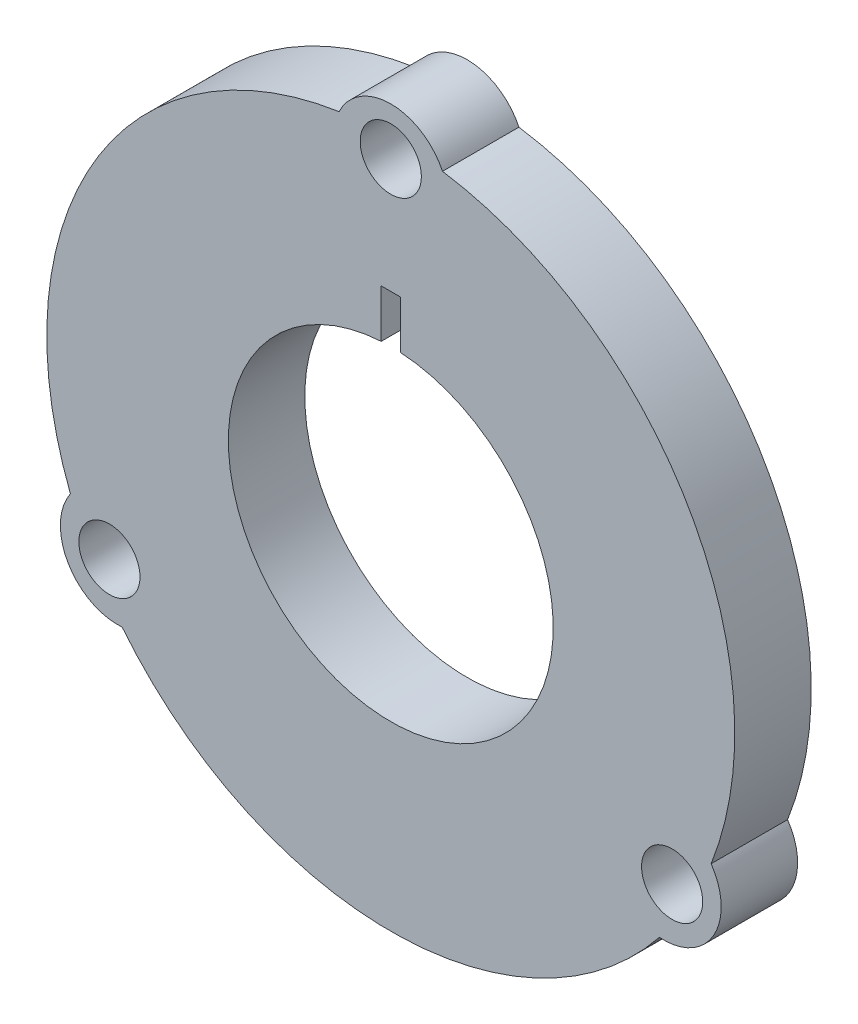
ISO-10303-21;
HEADER;
FILE_DESCRIPTION(('STEP AP214'),'2;1');
FILE_NAME('part.step','',(''),(''),'','','');
FILE_SCHEMA(('AUTOMOTIVE_DESIGN { 1 0 10303 214 1 1 1 1 }'));
ENDSEC;
DATA;
#1=APPLICATION_CONTEXT('core data for automotive mechanical design processes');
#2=APPLICATION_PROTOCOL_DEFINITION('international standard','automotive_design',2000,#1);
#3=PRODUCT_CONTEXT('',#1,'mechanical');
#4=PRODUCT('Part','Part','',(#3));
#5=PRODUCT_RELATED_PRODUCT_CATEGORY('part','',(#4));
#6=PRODUCT_DEFINITION_FORMATION('','',#4);
#7=PRODUCT_DEFINITION_CONTEXT('part definition',#1,'design');
#8=PRODUCT_DEFINITION('design','',#6,#7);
#9=PRODUCT_DEFINITION_SHAPE('','',#8);
#10=(LENGTH_UNIT() NAMED_UNIT(*) SI_UNIT(.MILLI.,.METRE.));
#11=(NAMED_UNIT(*) PLANE_ANGLE_UNIT() SI_UNIT($,.RADIAN.));
#12=(NAMED_UNIT(*) SI_UNIT($,.STERADIAN.) SOLID_ANGLE_UNIT());
#13=UNCERTAINTY_MEASURE_WITH_UNIT(LENGTH_MEASURE(1.E-05),#10,'distance_accuracy_value','');
#14=(GEOMETRIC_REPRESENTATION_CONTEXT(3) GLOBAL_UNCERTAINTY_ASSIGNED_CONTEXT((#13)) GLOBAL_UNIT_ASSIGNED_CONTEXT((#10,
#11,#12)) REPRESENTATION_CONTEXT('',''));
#15=CARTESIAN_POINT('',(0.,0.,0.));
#16=DIRECTION('',(0.,0.,1.));
#17=DIRECTION('',(1.,0.,0.));
#18=AXIS2_PLACEMENT_3D('',#15,#16,#17);
#19=CARTESIAN_POINT('',(0.,8.25,4.));
#20=DIRECTION('',(0.,0.,1.));
#21=DIRECTION('',(1.,0.,0.));
#22=AXIS2_PLACEMENT_3D('',#19,#20,#21);
#23=PLANE('',#22);
#24=CARTESIAN_POINT('',(0.,17.,4.));
#25=DIRECTION('',(0.,0.,1.));
#26=DIRECTION('',(1.,0.,0.));
#27=AXIS2_PLACEMENT_3D('',#24,#25,#26);
#28=CIRCLE('',#27,1.6);
#29=CARTESIAN_POINT('',(1.6,17.,4.));
#30=VERTEX_POINT('',#29);
#31=EDGE_CURVE('E154',#30,#30,#28,.T.);
#32=ORIENTED_EDGE('',*,*,#31,.F.);
#33=EDGE_LOOP('',(#32));
#34=FACE_BOUND('',#33,.T.);
#35=CARTESIAN_POINT('',(14.7224318643365,-8.49999999999936,4.));
#36=DIRECTION('',(0.,0.,1.));
#37=DIRECTION('',(1.,0.,0.));
#38=AXIS2_PLACEMENT_3D('',#35,#36,#37);
#39=CIRCLE('',#38,1.60000000000094);
#40=CARTESIAN_POINT('',(16.3224318643375,-8.49999999999936,4.));
#41=VERTEX_POINT('',#40);
#42=EDGE_CURVE('E322',#41,#41,#39,.T.);
#43=ORIENTED_EDGE('',*,*,#42,.F.);
#44=EDGE_LOOP('',(#43));
#45=FACE_BOUND('',#44,.T.);
#46=CARTESIAN_POINT('',(-14.7224318643344,-8.50000000000063,4.));
#47=DIRECTION('',(0.,0.,1.));
#48=DIRECTION('',(1.,0.,0.));
#49=AXIS2_PLACEMENT_3D('',#46,#47,#48);
#50=CIRCLE('',#49,1.60000000000137);
#51=CARTESIAN_POINT('',(-13.122431864333,-8.50000000000063,4.));
#52=VERTEX_POINT('',#51);
#53=EDGE_CURVE('E176',#52,#52,#50,.T.);
#54=ORIENTED_EDGE('',*,*,#53,.F.);
#55=EDGE_LOOP('',(#54));
#56=FACE_BOUND('',#55,.T.);
#57=CARTESIAN_POINT('',(0.,0.,4.));
#58=DIRECTION('',(0.,0.,1.));
#59=DIRECTION('',(1.,0.,0.));
#60=AXIS2_PLACEMENT_3D('',#57,#58,#59);
#61=CIRCLE('',#60,18.);
#62=CARTESIAN_POINT('',(16.7642567195958,-6.55436470144018,4.));
#63=VERTEX_POINT('',#62);
#64=CARTESIAN_POINT('',(2.70588202268129,17.7954545454543,4.));
#65=VERTEX_POINT('',#64);
#66=EDGE_CURVE('E142',#63,#65,#61,.T.);
#67=ORIENTED_EDGE('',*,*,#66,.T.);
#68=CARTESIAN_POINT('',(0.,16.5,4.));
#69=DIRECTION('',(0.,0.,1.));
#70=DIRECTION('',(1.,0.,0.));
#71=AXIS2_PLACEMENT_3D('',#68,#69,#70);
#72=CIRCLE('',#71,3.00000000000133);
#73=CARTESIAN_POINT('',(-2.70588202268129,17.7954545454543,4.));
#74=VERTEX_POINT('',#73);
#75=EDGE_CURVE('E93',#65,#74,#72,.T.);
#76=ORIENTED_EDGE('',*,*,#75,.T.);
#77=CARTESIAN_POINT('',(0.,0.,4.));
#78=DIRECTION('',(0.,0.,1.));
#79=DIRECTION('',(1.,0.,0.));
#80=AXIS2_PLACEMENT_3D('',#77,#78,#79);
#81=CIRCLE('',#80,18.);
#82=CARTESIAN_POINT('',(-16.7642567195948,-6.55436470144291,4.));
#83=VERTEX_POINT('',#82);
#84=EDGE_CURVE('E109',#74,#83,#81,.T.);
#85=ORIENTED_EDGE('',*,*,#84,.T.);
#86=CARTESIAN_POINT('',(-14.2894191624422,-8.25000000000061,4.));
#87=DIRECTION('',(0.,0.,1.));
#88=DIRECTION('',(1.,0.,0.));
#89=AXIS2_PLACEMENT_3D('',#86,#87,#88);
#90=CIRCLE('',#89,3.00000000000133);
#91=CARTESIAN_POINT('',(-14.0583746969135,-11.2410898440134,4.));
#92=VERTEX_POINT('',#91);
#93=EDGE_CURVE('E102',#83,#92,#90,.T.);
#94=ORIENTED_EDGE('',*,*,#93,.T.);
#95=CARTESIAN_POINT('',(0.,0.,4.));
#96=DIRECTION('',(0.,0.,1.));
#97=DIRECTION('',(1.,0.,0.));
#98=AXIS2_PLACEMENT_3D('',#95,#96,#97);
#99=CIRCLE('',#98,18.);
#100=CARTESIAN_POINT('',(14.0583746969146,-11.2410898440121,4.));
#101=VERTEX_POINT('',#100);
#102=EDGE_CURVE('E106',#92,#101,#99,.T.);
#103=ORIENTED_EDGE('',*,*,#102,.T.);
#104=CARTESIAN_POINT('',(14.2894191624443,-8.24999999999938,4.));
#105=DIRECTION('',(0.,0.,1.));
#106=DIRECTION('',(1.,0.,0.));
#107=AXIS2_PLACEMENT_3D('',#104,#105,#106);
#108=CIRCLE('',#107,3.00000000000128);
#109=EDGE_CURVE('E57',#101,#63,#108,.T.);
#110=ORIENTED_EDGE('',*,*,#109,.T.);
#111=EDGE_LOOP('',(#67,#76,#85,#94,#103,#110));
#112=FACE_BOUND('',#111,.T.);
#113=DIRECTION('',(1.,0.,0.));
#114=VECTOR('',#113,1.);
#115=CARTESIAN_POINT('',(0.,11.,4.));
#116=LINE('',#115,#114);
#117=CARTESIAN_POINT('',(-0.5,11.,4.));
#118=VERTEX_POINT('',#117);
#119=CARTESIAN_POINT('',(0.5,11.,4.));
#120=VERTEX_POINT('',#119);
#121=EDGE_CURVE('E316',#118,#120,#116,.T.);
#122=ORIENTED_EDGE('',*,*,#121,.T.);
#123=DIRECTION('',(0.,-1.,0.));
#124=VECTOR('',#123,1.);
#125=CARTESIAN_POINT('',(0.5,0.,4.));
#126=LINE('',#125,#124);
#127=CARTESIAN_POINT('',(0.5,8.48528137423857,4.));
#128=VERTEX_POINT('',#127);
#129=EDGE_CURVE('E351',#120,#128,#126,.T.);
#130=ORIENTED_EDGE('',*,*,#129,.T.);
#131=CARTESIAN_POINT('',(0.,0.,4.));
#132=DIRECTION('',(0.,0.,1.));
#133=DIRECTION('',(1.,0.,0.));
#134=AXIS2_PLACEMENT_3D('',#131,#132,#133);
#135=CIRCLE('',#134,8.5);
#136=CARTESIAN_POINT('',(-0.5,8.48528137423857,4.));
#137=VERTEX_POINT('',#136);
#138=EDGE_CURVE('E134',#137,#128,#135,.T.);
#139=ORIENTED_EDGE('',*,*,#138,.F.);
#140=DIRECTION('',(0.,1.,0.));
#141=VECTOR('',#140,1.);
#142=CARTESIAN_POINT('',(-0.5,0.,4.));
#143=LINE('',#142,#141);
#144=EDGE_CURVE('E48',#137,#118,#143,.T.);
#145=ORIENTED_EDGE('',*,*,#144,.T.);
#146=EDGE_LOOP('',(#122,#130,#139,#145));
#147=FACE_BOUND('',#146,.T.);
#148=ADVANCED_FACE('F33',(#34,#45,#56,#112,#147),#23,.T.);
#149=CARTESIAN_POINT('',(0.,8.25,0.));
#150=DIRECTION('',(0.,0.,1.));
#151=DIRECTION('',(1.,0.,0.));
#152=AXIS2_PLACEMENT_3D('',#149,#150,#151);
#153=PLANE('',#152);
#154=CARTESIAN_POINT('',(0.,0.,0.));
#155=DIRECTION('',(0.,0.,1.));
#156=DIRECTION('',(1.,0.,0.));
#157=AXIS2_PLACEMENT_3D('',#154,#155,#156);
#158=CIRCLE('',#157,18.);
#159=CARTESIAN_POINT('',(16.7642567195958,-6.55436470144018,0.));
#160=VERTEX_POINT('',#159);
#161=CARTESIAN_POINT('',(2.70588202268129,17.7954545454543,0.));
#162=VERTEX_POINT('',#161);
#163=EDGE_CURVE('E130',#160,#162,#158,.T.);
#164=ORIENTED_EDGE('',*,*,#163,.F.);
#165=CARTESIAN_POINT('',(14.2894191624443,-8.24999999999938,0.));
#166=DIRECTION('',(0.,0.,1.));
#167=DIRECTION('',(1.,0.,0.));
#168=AXIS2_PLACEMENT_3D('',#165,#166,#167);
#169=CIRCLE('',#168,3.00000000000128);
#170=CARTESIAN_POINT('',(14.0583746969146,-11.2410898440121,0.));
#171=VERTEX_POINT('',#170);
#172=EDGE_CURVE('E84',#171,#160,#169,.T.);
#173=ORIENTED_EDGE('',*,*,#172,.F.);
#174=CARTESIAN_POINT('',(0.,0.,0.));
#175=DIRECTION('',(0.,0.,1.));
#176=DIRECTION('',(1.,0.,0.));
#177=AXIS2_PLACEMENT_3D('',#174,#175,#176);
#178=CIRCLE('',#177,18.);
#179=CARTESIAN_POINT('',(-14.0583746969135,-11.2410898440134,0.));
#180=VERTEX_POINT('',#179);
#181=EDGE_CURVE('E139',#180,#171,#178,.T.);
#182=ORIENTED_EDGE('',*,*,#181,.F.);
#183=CARTESIAN_POINT('',(-14.2894191624422,-8.25000000000061,0.));
#184=DIRECTION('',(0.,0.,1.));
#185=DIRECTION('',(1.,0.,0.));
#186=AXIS2_PLACEMENT_3D('',#183,#184,#185);
#187=CIRCLE('',#186,3.00000000000133);
#188=CARTESIAN_POINT('',(-16.7642567195948,-6.55436470144291,0.));
#189=VERTEX_POINT('',#188);
#190=EDGE_CURVE('E118',#189,#180,#187,.T.);
#191=ORIENTED_EDGE('',*,*,#190,.F.);
#192=CARTESIAN_POINT('',(0.,0.,0.));
#193=DIRECTION('',(0.,0.,1.));
#194=DIRECTION('',(1.,0.,0.));
#195=AXIS2_PLACEMENT_3D('',#192,#193,#194);
#196=CIRCLE('',#195,18.);
#197=CARTESIAN_POINT('',(-2.70588202268129,17.7954545454543,0.));
#198=VERTEX_POINT('',#197);
#199=EDGE_CURVE('E136',#198,#189,#196,.T.);
#200=ORIENTED_EDGE('',*,*,#199,.F.);
#201=CARTESIAN_POINT('',(0.,16.5,0.));
#202=DIRECTION('',(0.,0.,1.));
#203=DIRECTION('',(1.,0.,0.));
#204=AXIS2_PLACEMENT_3D('',#201,#202,#203);
#205=CIRCLE('',#204,3.00000000000133);
#206=EDGE_CURVE('E133',#162,#198,#205,.T.);
#207=ORIENTED_EDGE('',*,*,#206,.F.);
#208=EDGE_LOOP('',(#164,#173,#182,#191,#200,#207));
#209=FACE_BOUND('',#208,.T.);
#210=CARTESIAN_POINT('',(-14.7224318643344,-8.50000000000063,0.));
#211=DIRECTION('',(0.,0.,1.));
#212=DIRECTION('',(1.,0.,0.));
#213=AXIS2_PLACEMENT_3D('',#210,#211,#212);
#214=CIRCLE('',#213,1.60000000000137);
#215=CARTESIAN_POINT('',(-13.122431864333,-8.50000000000063,0.));
#216=VERTEX_POINT('',#215);
#217=EDGE_CURVE('E150',#216,#216,#214,.T.);
#218=ORIENTED_EDGE('',*,*,#217,.T.);
#219=EDGE_LOOP('',(#218));
#220=FACE_BOUND('',#219,.T.);
#221=CARTESIAN_POINT('',(14.7224318643365,-8.49999999999936,0.));
#222=DIRECTION('',(0.,0.,1.));
#223=DIRECTION('',(1.,0.,0.));
#224=AXIS2_PLACEMENT_3D('',#221,#222,#223);
#225=CIRCLE('',#224,1.60000000000094);
#226=CARTESIAN_POINT('',(16.3224318643375,-8.49999999999936,0.));
#227=VERTEX_POINT('',#226);
#228=EDGE_CURVE('E153',#227,#227,#225,.T.);
#229=ORIENTED_EDGE('',*,*,#228,.T.);
#230=EDGE_LOOP('',(#229));
#231=FACE_BOUND('',#230,.T.);
#232=CARTESIAN_POINT('',(0.,17.,0.));
#233=DIRECTION('',(0.,0.,1.));
#234=DIRECTION('',(1.,0.,0.));
#235=AXIS2_PLACEMENT_3D('',#232,#233,#234);
#236=CIRCLE('',#235,1.6);
#237=CARTESIAN_POINT('',(1.6,17.,0.));
#238=VERTEX_POINT('',#237);
#239=EDGE_CURVE('E157',#238,#238,#236,.T.);
#240=ORIENTED_EDGE('',*,*,#239,.T.);
#241=EDGE_LOOP('',(#240));
#242=FACE_BOUND('',#241,.T.);
#243=DIRECTION('',(0.,-1.,0.));
#244=VECTOR('',#243,1.);
#245=CARTESIAN_POINT('',(0.5,8.25,0.));
#246=LINE('',#245,#244);
#247=CARTESIAN_POINT('',(0.5,11.,0.));
#248=VERTEX_POINT('',#247);
#249=CARTESIAN_POINT('',(0.5,8.48528137423857,-6.E-06));
#250=VERTEX_POINT('',#249);
#251=EDGE_CURVE('E310',#248,#250,#246,.T.);
#252=ORIENTED_EDGE('',*,*,#251,.F.);
#253=DIRECTION('',(1.,0.,0.));
#254=VECTOR('',#253,1.);
#255=CARTESIAN_POINT('',(0.,11.,0.));
#256=LINE('',#255,#254);
#257=CARTESIAN_POINT('',(-0.5,11.,0.));
#258=VERTEX_POINT('',#257);
#259=EDGE_CURVE('E11',#258,#248,#256,.T.);
#260=ORIENTED_EDGE('',*,*,#259,.F.);
#261=DIRECTION('',(0.,1.,0.));
#262=VECTOR('',#261,1.);
#263=CARTESIAN_POINT('',(-0.5,8.25,0.));
#264=LINE('',#263,#262);
#265=CARTESIAN_POINT('',(-0.5,8.48528137423857,0.));
#266=VERTEX_POINT('',#265);
#267=EDGE_CURVE('E302',#266,#258,#264,.T.);
#268=ORIENTED_EDGE('',*,*,#267,.F.);
#269=CARTESIAN_POINT('',(0.,0.,0.));
#270=DIRECTION('',(0.,0.,1.));
#271=DIRECTION('',(1.,0.,0.));
#272=AXIS2_PLACEMENT_3D('',#269,#270,#271);
#273=CIRCLE('',#272,8.5);
#274=EDGE_CURVE('E160',#266,#250,#273,.T.);
#275=ORIENTED_EDGE('',*,*,#274,.T.);
#276=EDGE_LOOP('',(#252,#260,#268,#275));
#277=FACE_BOUND('',#276,.T.);
#278=ADVANCED_FACE('F187',(#209,#220,#231,#242,#277),#153,.F.);
#279=CARTESIAN_POINT('',(0.,0.,4.));
#280=DIRECTION('',(0.,0.,-1.));
#281=DIRECTION('',(-1.,0.,0.));
#282=AXIS2_PLACEMENT_3D('',#279,#280,#281);
#283=CYLINDRICAL_SURFACE('',#282,8.5);
#284=ORIENTED_EDGE('',*,*,#138,.T.);
#285=DIRECTION('',(0.,0.,-1.));
#286=VECTOR('',#285,1.);
#287=CARTESIAN_POINT('',(0.5,8.48528137423857,4.));
#288=LINE('',#287,#286);
#289=EDGE_CURVE('E346',#128,#250,#288,.T.);
#290=ORIENTED_EDGE('',*,*,#289,.T.);
#291=ORIENTED_EDGE('',*,*,#274,.F.);
#292=DIRECTION('',(0.,0.,-1.));
#293=VECTOR('',#292,1.);
#294=CARTESIAN_POINT('',(-0.5,8.48528137423857,4.));
#295=LINE('',#294,#293);
#296=EDGE_CURVE('E308',#137,#266,#295,.T.);
#297=ORIENTED_EDGE('',*,*,#296,.F.);
#298=EDGE_LOOP('',(#284,#290,#291,#297));
#299=FACE_BOUND('',#298,.T.);
#300=ADVANCED_FACE('F192',(#299),#283,.F.);
#301=CARTESIAN_POINT('',(0.,0.,4.));
#302=DIRECTION('',(0.,0.,-1.));
#303=DIRECTION('',(-1.,0.,0.));
#304=AXIS2_PLACEMENT_3D('',#301,#302,#303);
#305=CYLINDRICAL_SURFACE('',#304,18.);
#306=ORIENTED_EDGE('',*,*,#163,.T.);
#307=DIRECTION('',(0.,0.,-1.));
#308=VECTOR('',#307,1.);
#309=CARTESIAN_POINT('',(2.70588202268129,17.7954545454543,4.));
#310=LINE('',#309,#308);
#311=EDGE_CURVE('E41',#65,#162,#310,.T.);
#312=ORIENTED_EDGE('',*,*,#311,.F.);
#313=ORIENTED_EDGE('',*,*,#66,.F.);
#314=DIRECTION('',(0.,0.,-1.));
#315=VECTOR('',#314,1.);
#316=CARTESIAN_POINT('',(16.7642567195958,-6.55436470144018,4.));
#317=LINE('',#316,#315);
#318=EDGE_CURVE('E126',#63,#160,#317,.T.);
#319=ORIENTED_EDGE('',*,*,#318,.T.);
#320=EDGE_LOOP('',(#306,#312,#313,#319));
#321=FACE_BOUND('',#320,.T.);
#322=ADVANCED_FACE('F35',(#321),#305,.T.);
#323=CARTESIAN_POINT('',(0.,16.5,4.));
#324=DIRECTION('',(0.,0.,-1.));
#325=DIRECTION('',(-1.,0.,0.));
#326=AXIS2_PLACEMENT_3D('',#323,#324,#325);
#327=CYLINDRICAL_SURFACE('',#326,3.00000000000133);
#328=ORIENTED_EDGE('',*,*,#206,.T.);
#329=DIRECTION('',(0.,0.,-1.));
#330=VECTOR('',#329,1.);
#331=CARTESIAN_POINT('',(-2.70588202268129,17.7954545454543,4.));
#332=LINE('',#331,#330);
#333=EDGE_CURVE('E146',#74,#198,#332,.T.);
#334=ORIENTED_EDGE('',*,*,#333,.F.);
#335=ORIENTED_EDGE('',*,*,#75,.F.);
#336=ORIENTED_EDGE('',*,*,#311,.T.);
#337=EDGE_LOOP('',(#328,#334,#335,#336));
#338=FACE_BOUND('',#337,.T.);
#339=ADVANCED_FACE('F181',(#338),#327,.T.);
#340=CARTESIAN_POINT('',(0.,0.,4.));
#341=DIRECTION('',(0.,0.,-1.));
#342=DIRECTION('',(-1.,0.,0.));
#343=AXIS2_PLACEMENT_3D('',#340,#341,#342);
#344=CYLINDRICAL_SURFACE('',#343,18.);
#345=ORIENTED_EDGE('',*,*,#199,.T.);
#346=DIRECTION('',(0.,0.,-1.));
#347=VECTOR('',#346,1.);
#348=CARTESIAN_POINT('',(-16.7642567195948,-6.55436470144291,4.));
#349=LINE('',#348,#347);
#350=EDGE_CURVE('E121',#83,#189,#349,.T.);
#351=ORIENTED_EDGE('',*,*,#350,.F.);
#352=ORIENTED_EDGE('',*,*,#84,.F.);
#353=ORIENTED_EDGE('',*,*,#333,.T.);
#354=EDGE_LOOP('',(#345,#351,#352,#353));
#355=FACE_BOUND('',#354,.T.);
#356=ADVANCED_FACE('F184',(#355),#344,.T.);
#357=CARTESIAN_POINT('',(-14.2894191624422,-8.25000000000061,4.));
#358=DIRECTION('',(0.,0.,-1.));
#359=DIRECTION('',(-1.,0.,0.));
#360=AXIS2_PLACEMENT_3D('',#357,#358,#359);
#361=CYLINDRICAL_SURFACE('',#360,3.00000000000133);
#362=ORIENTED_EDGE('',*,*,#190,.T.);
#363=DIRECTION('',(0.,0.,-1.));
#364=VECTOR('',#363,1.);
#365=CARTESIAN_POINT('',(-14.0583746969135,-11.2410898440134,4.));
#366=LINE('',#365,#364);
#367=EDGE_CURVE('E115',#92,#180,#366,.T.);
#368=ORIENTED_EDGE('',*,*,#367,.F.);
#369=ORIENTED_EDGE('',*,*,#93,.F.);
#370=ORIENTED_EDGE('',*,*,#350,.T.);
#371=EDGE_LOOP('',(#362,#368,#369,#370));
#372=FACE_BOUND('',#371,.T.);
#373=ADVANCED_FACE('F116',(#372),#361,.T.);
#374=CARTESIAN_POINT('',(0.,0.,4.));
#375=DIRECTION('',(0.,0.,-1.));
#376=DIRECTION('',(-1.,0.,0.));
#377=AXIS2_PLACEMENT_3D('',#374,#375,#376);
#378=CYLINDRICAL_SURFACE('',#377,18.);
#379=ORIENTED_EDGE('',*,*,#181,.T.);
#380=DIRECTION('',(0.,0.,-1.));
#381=VECTOR('',#380,1.);
#382=CARTESIAN_POINT('',(14.0583746969146,-11.2410898440121,4.));
#383=LINE('',#382,#381);
#384=EDGE_CURVE('E122',#101,#171,#383,.T.);
#385=ORIENTED_EDGE('',*,*,#384,.F.);
#386=ORIENTED_EDGE('',*,*,#102,.F.);
#387=ORIENTED_EDGE('',*,*,#367,.T.);
#388=EDGE_LOOP('',(#379,#385,#386,#387));
#389=FACE_BOUND('',#388,.T.);
#390=ADVANCED_FACE('F124',(#389),#378,.T.);
#391=CARTESIAN_POINT('',(14.2894191624443,-8.24999999999938,4.));
#392=DIRECTION('',(0.,0.,-1.));
#393=DIRECTION('',(-1.,0.,0.));
#394=AXIS2_PLACEMENT_3D('',#391,#392,#393);
#395=CYLINDRICAL_SURFACE('',#394,3.00000000000128);
#396=ORIENTED_EDGE('',*,*,#172,.T.);
#397=ORIENTED_EDGE('',*,*,#318,.F.);
#398=ORIENTED_EDGE('',*,*,#109,.F.);
#399=ORIENTED_EDGE('',*,*,#384,.T.);
#400=EDGE_LOOP('',(#396,#397,#398,#399));
#401=FACE_BOUND('',#400,.T.);
#402=ADVANCED_FACE('F189',(#401),#395,.T.);
#403=CARTESIAN_POINT('',(-14.7224318643344,-8.50000000000063,-6.));
#404=DIRECTION('',(0.,0.,1.));
#405=DIRECTION('',(1.,0.,0.));
#406=AXIS2_PLACEMENT_3D('',#403,#404,#405);
#407=CYLINDRICAL_SURFACE('',#406,1.60000000000137);
#408=ORIENTED_EDGE('',*,*,#53,.T.);
#409=EDGE_LOOP('',(#408));
#410=FACE_BOUND('',#409,.T.);
#411=ORIENTED_EDGE('',*,*,#217,.F.);
#412=EDGE_LOOP('',(#411));
#413=FACE_BOUND('',#412,.T.);
#414=ADVANCED_FACE('F212',(#410,#413),#407,.F.);
#415=CARTESIAN_POINT('',(14.7224318643365,-8.49999999999936,-6.));
#416=DIRECTION('',(0.,0.,1.));
#417=DIRECTION('',(1.,0.,0.));
#418=AXIS2_PLACEMENT_3D('',#415,#416,#417);
#419=CYLINDRICAL_SURFACE('',#418,1.60000000000094);
#420=ORIENTED_EDGE('',*,*,#42,.T.);
#421=EDGE_LOOP('',(#420));
#422=FACE_BOUND('',#421,.T.);
#423=ORIENTED_EDGE('',*,*,#228,.F.);
#424=EDGE_LOOP('',(#423));
#425=FACE_BOUND('',#424,.T.);
#426=ADVANCED_FACE('F240',(#422,#425),#419,.F.);
#427=CARTESIAN_POINT('',(0.,17.,-6.));
#428=DIRECTION('',(0.,0.,1.));
#429=DIRECTION('',(1.,0.,0.));
#430=AXIS2_PLACEMENT_3D('',#427,#428,#429);
#431=CYLINDRICAL_SURFACE('',#430,1.6);
#432=ORIENTED_EDGE('',*,*,#31,.T.);
#433=EDGE_LOOP('',(#432));
#434=FACE_BOUND('',#433,.T.);
#435=ORIENTED_EDGE('',*,*,#239,.F.);
#436=EDGE_LOOP('',(#435));
#437=FACE_BOUND('',#436,.T.);
#438=ADVANCED_FACE('F247',(#434,#437),#431,.F.);
#439=CARTESIAN_POINT('',(0.,11.,-1.2E-05));
#440=DIRECTION('',(0.,-1.,0.));
#441=DIRECTION('',(0.,0.,-1.));
#442=AXIS2_PLACEMENT_3D('',#439,#440,#441);
#443=PLANE('',#442);
#444=ORIENTED_EDGE('',*,*,#259,.T.);
#445=DIRECTION('',(0.,0.,1.));
#446=VECTOR('',#445,1.);
#447=CARTESIAN_POINT('',(0.5,11.,-1.2E-05));
#448=LINE('',#447,#446);
#449=EDGE_CURVE('E311',#248,#120,#448,.T.);
#450=ORIENTED_EDGE('',*,*,#449,.T.);
#451=ORIENTED_EDGE('',*,*,#121,.F.);
#452=DIRECTION('',(0.,0.,1.));
#453=VECTOR('',#452,1.);
#454=CARTESIAN_POINT('',(-0.5,11.,-1.2E-05));
#455=LINE('',#454,#453);
#456=EDGE_CURVE('E305',#258,#118,#455,.T.);
#457=ORIENTED_EDGE('',*,*,#456,.F.);
#458=EDGE_LOOP('',(#444,#450,#451,#457));
#459=FACE_BOUND('',#458,.T.);
#460=ADVANCED_FACE('F254',(#459),#443,.T.);
#461=CARTESIAN_POINT('',(0.5,0.,-1.2E-05));
#462=DIRECTION('',(-1.,0.,0.));
#463=DIRECTION('',(0.,0.,1.));
#464=AXIS2_PLACEMENT_3D('',#461,#462,#463);
#465=PLANE('',#464);
#466=ORIENTED_EDGE('',*,*,#251,.T.);
#467=ORIENTED_EDGE('',*,*,#289,.F.);
#468=ORIENTED_EDGE('',*,*,#129,.F.);
#469=ORIENTED_EDGE('',*,*,#449,.F.);
#470=EDGE_LOOP('',(#466,#467,#468,#469));
#471=FACE_BOUND('',#470,.T.);
#472=ADVANCED_FACE('F277',(#471),#465,.T.);
#473=CARTESIAN_POINT('',(-0.5,0.,-1.2E-05));
#474=DIRECTION('',(1.,0.,0.));
#475=DIRECTION('',(0.,0.,-1.));
#476=AXIS2_PLACEMENT_3D('',#473,#474,#475);
#477=PLANE('',#476);
#478=ORIENTED_EDGE('',*,*,#267,.T.);
#479=ORIENTED_EDGE('',*,*,#456,.T.);
#480=ORIENTED_EDGE('',*,*,#144,.F.);
#481=ORIENTED_EDGE('',*,*,#296,.T.);
#482=EDGE_LOOP('',(#478,#479,#480,#481));
#483=FACE_BOUND('',#482,.T.);
#484=ADVANCED_FACE('F284',(#483),#477,.T.);
#485=CLOSED_SHELL('',(#148,#278,#300,#322,#339,#356,#373,#390,#402,#414,#426,#438,#460,#472,#484));
#486=MANIFOLD_SOLID_BREP('B2',#485);
#487=ADVANCED_BREP_SHAPE_REPRESENTATION('',(#18,#486),#14);
#488=SHAPE_DEFINITION_REPRESENTATION(#9,#487);
ENDSEC;
END-ISO-10303-21;
